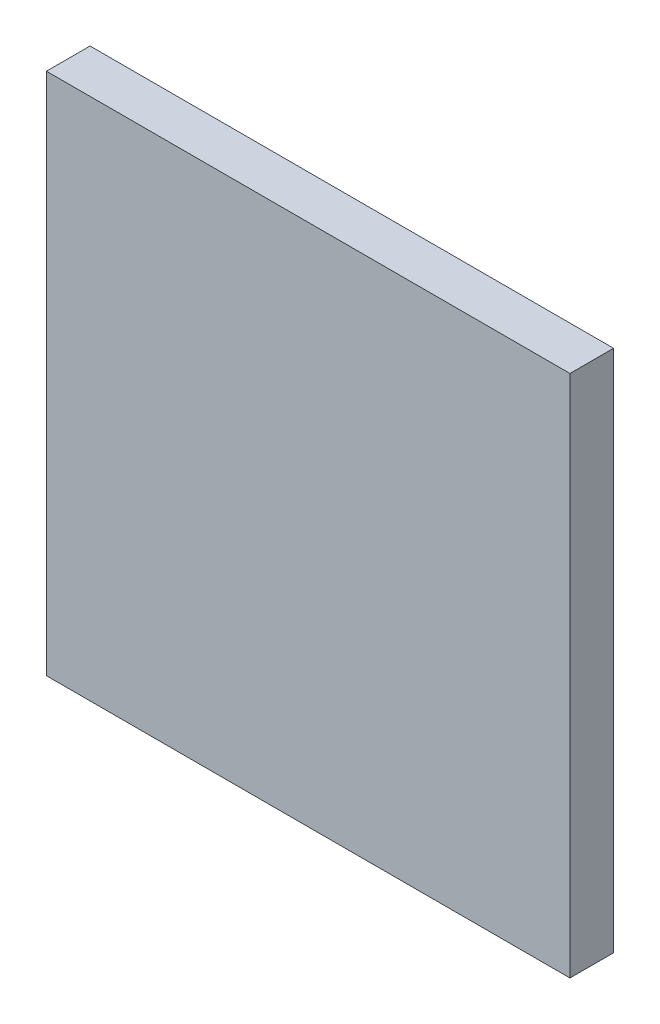
ISO-10303-21;
HEADER;
FILE_DESCRIPTION(('STEP AP214'),'2;1');
FILE_NAME('part.step','',(''),(''),'','','');
FILE_SCHEMA(('AUTOMOTIVE_DESIGN { 1 0 10303 214 1 1 1 1 }'));
ENDSEC;
DATA;
#1=APPLICATION_CONTEXT('core data for automotive mechanical design processes');
#2=APPLICATION_PROTOCOL_DEFINITION('international standard','automotive_design',2000,#1);
#3=PRODUCT_CONTEXT('',#1,'mechanical');
#4=PRODUCT('Part','Part','',(#3));
#5=PRODUCT_RELATED_PRODUCT_CATEGORY('part','',(#4));
#6=PRODUCT_DEFINITION_FORMATION('','',#4);
#7=PRODUCT_DEFINITION_CONTEXT('part definition',#1,'design');
#8=PRODUCT_DEFINITION('design','',#6,#7);
#9=PRODUCT_DEFINITION_SHAPE('','',#8);
#10=(LENGTH_UNIT() NAMED_UNIT(*) SI_UNIT(.MILLI.,.METRE.));
#11=(NAMED_UNIT(*) PLANE_ANGLE_UNIT() SI_UNIT($,.RADIAN.));
#12=(NAMED_UNIT(*) SI_UNIT($,.STERADIAN.) SOLID_ANGLE_UNIT());
#13=UNCERTAINTY_MEASURE_WITH_UNIT(LENGTH_MEASURE(1.E-05),#10,'distance_accuracy_value','');
#14=(GEOMETRIC_REPRESENTATION_CONTEXT(3) GLOBAL_UNCERTAINTY_ASSIGNED_CONTEXT((#13)) GLOBAL_UNIT_ASSIGNED_CONTEXT((#10,
#11,#12)) REPRESENTATION_CONTEXT('',''));
#15=CARTESIAN_POINT('',(0.,0.,0.));
#16=DIRECTION('',(0.,0.,1.));
#17=DIRECTION('',(1.,0.,0.));
#18=AXIS2_PLACEMENT_3D('',#15,#16,#17);
#19=CARTESIAN_POINT('',(0.,0.,6.35));
#20=DIRECTION('',(1.,0.,0.));
#21=DIRECTION('',(0.,1.,0.));
#22=AXIS2_PLACEMENT_3D('',#19,#20,#21);
#23=PLANE('',#22);
#24=DIRECTION('',(0.,-1.,0.));
#25=VECTOR('',#24,1.);
#26=CARTESIAN_POINT('',(0.,0.,0.));
#27=LINE('',#26,#25);
#28=CARTESIAN_POINT('',(0.,76.2,0.));
#29=VERTEX_POINT('',#28);
#30=CARTESIAN_POINT('',(0.,0.,0.));
#31=VERTEX_POINT('',#30);
#32=EDGE_CURVE('E96',#29,#31,#27,.T.);
#33=ORIENTED_EDGE('',*,*,#32,.T.);
#34=DIRECTION('',(0.,0.,-1.));
#35=VECTOR('',#34,1.);
#36=CARTESIAN_POINT('',(0.,0.,6.35));
#37=LINE('',#36,#35);
#38=CARTESIAN_POINT('',(0.,0.,6.35));
#39=VERTEX_POINT('',#38);
#40=EDGE_CURVE('E11',#39,#31,#37,.T.);
#41=ORIENTED_EDGE('',*,*,#40,.F.);
#42=DIRECTION('',(0.,-1.,0.));
#43=VECTOR('',#42,1.);
#44=CARTESIAN_POINT('',(0.,0.,6.35));
#45=LINE('',#44,#43);
#46=CARTESIAN_POINT('',(0.,76.2,6.35));
#47=VERTEX_POINT('',#46);
#48=EDGE_CURVE('E84',#47,#39,#45,.T.);
#49=ORIENTED_EDGE('',*,*,#48,.F.);
#50=DIRECTION('',(0.,0.,-1.));
#51=VECTOR('',#50,1.);
#52=CARTESIAN_POINT('',(0.,76.2,6.35));
#53=LINE('',#52,#51);
#54=EDGE_CURVE('E92',#47,#29,#53,.T.);
#55=ORIENTED_EDGE('',*,*,#54,.T.);
#56=EDGE_LOOP('',(#33,#41,#49,#55));
#57=FACE_BOUND('',#56,.T.);
#58=ADVANCED_FACE('F33',(#57),#23,.F.);
#59=CARTESIAN_POINT('',(0.,0.,6.35));
#60=DIRECTION('',(0.,1.,0.));
#61=DIRECTION('',(0.,0.,1.));
#62=AXIS2_PLACEMENT_3D('',#59,#60,#61);
#63=PLANE('',#62);
#64=DIRECTION('',(1.,0.,0.));
#65=VECTOR('',#64,1.);
#66=CARTESIAN_POINT('',(0.,0.,0.));
#67=LINE('',#66,#65);
#68=CARTESIAN_POINT('',(76.2,0.,0.));
#69=VERTEX_POINT('',#68);
#70=EDGE_CURVE('E88',#31,#69,#67,.T.);
#71=ORIENTED_EDGE('',*,*,#70,.T.);
#72=DIRECTION('',(0.,0.,-1.));
#73=VECTOR('',#72,1.);
#74=CARTESIAN_POINT('',(76.2,0.,6.35));
#75=LINE('',#74,#73);
#76=CARTESIAN_POINT('',(76.2,0.,6.35));
#77=VERTEX_POINT('',#76);
#78=EDGE_CURVE('E41',#77,#69,#75,.T.);
#79=ORIENTED_EDGE('',*,*,#78,.F.);
#80=DIRECTION('',(1.,0.,0.));
#81=VECTOR('',#80,1.);
#82=CARTESIAN_POINT('',(0.,0.,6.35));
#83=LINE('',#82,#81);
#84=EDGE_CURVE('E79',#39,#77,#83,.T.);
#85=ORIENTED_EDGE('',*,*,#84,.F.);
#86=ORIENTED_EDGE('',*,*,#40,.T.);
#87=EDGE_LOOP('',(#71,#79,#85,#86));
#88=FACE_BOUND('',#87,.T.);
#89=ADVANCED_FACE('F87',(#88),#63,.F.);
#90=CARTESIAN_POINT('',(76.2,0.,6.35));
#91=DIRECTION('',(-1.,0.,0.));
#92=DIRECTION('',(0.,-1.,0.));
#93=AXIS2_PLACEMENT_3D('',#90,#91,#92);
#94=PLANE('',#93);
#95=DIRECTION('',(0.,1.,0.));
#96=VECTOR('',#95,1.);
#97=CARTESIAN_POINT('',(76.2,0.,0.));
#98=LINE('',#97,#96);
#99=CARTESIAN_POINT('',(76.2,76.2,0.));
#100=VERTEX_POINT('',#99);
#101=EDGE_CURVE('E66',#69,#100,#98,.T.);
#102=ORIENTED_EDGE('',*,*,#101,.T.);
#103=DIRECTION('',(0.,0.,-1.));
#104=VECTOR('',#103,1.);
#105=CARTESIAN_POINT('',(76.2,76.2,6.35));
#106=LINE('',#105,#104);
#107=CARTESIAN_POINT('',(76.2,76.2,6.35));
#108=VERTEX_POINT('',#107);
#109=EDGE_CURVE('E89',#108,#100,#106,.T.);
#110=ORIENTED_EDGE('',*,*,#109,.F.);
#111=DIRECTION('',(0.,1.,0.));
#112=VECTOR('',#111,1.);
#113=CARTESIAN_POINT('',(76.2,0.,6.35));
#114=LINE('',#113,#112);
#115=EDGE_CURVE('E82',#77,#108,#114,.T.);
#116=ORIENTED_EDGE('',*,*,#115,.F.);
#117=ORIENTED_EDGE('',*,*,#78,.T.);
#118=EDGE_LOOP('',(#102,#110,#116,#117));
#119=FACE_BOUND('',#118,.T.);
#120=ADVANCED_FACE('F90',(#119),#94,.F.);
#121=CARTESIAN_POINT('',(0.,76.2,6.35));
#122=DIRECTION('',(0.,-1.,0.));
#123=DIRECTION('',(0.,0.,-1.));
#124=AXIS2_PLACEMENT_3D('',#121,#122,#123);
#125=PLANE('',#124);
#126=DIRECTION('',(-1.,0.,0.));
#127=VECTOR('',#126,1.);
#128=CARTESIAN_POINT('',(0.,76.2,0.));
#129=LINE('',#128,#127);
#130=EDGE_CURVE('E72',#100,#29,#129,.T.);
#131=ORIENTED_EDGE('',*,*,#130,.T.);
#132=ORIENTED_EDGE('',*,*,#54,.F.);
#133=DIRECTION('',(-1.,0.,0.));
#134=VECTOR('',#133,1.);
#135=CARTESIAN_POINT('',(0.,76.2,6.35));
#136=LINE('',#135,#134);
#137=EDGE_CURVE('E49',#108,#47,#136,.T.);
#138=ORIENTED_EDGE('',*,*,#137,.F.);
#139=ORIENTED_EDGE('',*,*,#109,.T.);
#140=EDGE_LOOP('',(#131,#132,#138,#139));
#141=FACE_BOUND('',#140,.T.);
#142=ADVANCED_FACE('F103',(#141),#125,.F.);
#143=CARTESIAN_POINT('',(0.,0.,6.35));
#144=DIRECTION('',(0.,0.,-1.));
#145=DIRECTION('',(-1.,0.,0.));
#146=AXIS2_PLACEMENT_3D('',#143,#144,#145);
#147=PLANE('',#146);
#148=ORIENTED_EDGE('',*,*,#48,.T.);
#149=ORIENTED_EDGE('',*,*,#84,.T.);
#150=ORIENTED_EDGE('',*,*,#115,.T.);
#151=ORIENTED_EDGE('',*,*,#137,.T.);
#152=EDGE_LOOP('',(#148,#149,#150,#151));
#153=FACE_BOUND('',#152,.T.);
#154=ADVANCED_FACE('F80',(#153),#147,.F.);
#155=CARTESIAN_POINT('',(0.,0.,0.));
#156=DIRECTION('',(0.,0.,-1.));
#157=DIRECTION('',(-1.,0.,0.));
#158=AXIS2_PLACEMENT_3D('',#155,#156,#157);
#159=PLANE('',#158);
#160=ORIENTED_EDGE('',*,*,#32,.F.);
#161=ORIENTED_EDGE('',*,*,#130,.F.);
#162=ORIENTED_EDGE('',*,*,#101,.F.);
#163=ORIENTED_EDGE('',*,*,#70,.F.);
#164=EDGE_LOOP('',(#160,#161,#162,#163));
#165=FACE_BOUND('',#164,.T.);
#166=ADVANCED_FACE('F106',(#165),#159,.T.);
#167=CLOSED_SHELL('',(#58,#89,#120,#142,#154,#166));
#168=MANIFOLD_SOLID_BREP('B2',#167);
#169=ADVANCED_BREP_SHAPE_REPRESENTATION('',(#18,#168),#14);
#170=SHAPE_DEFINITION_REPRESENTATION(#9,#169);
ENDSEC;
END-ISO-10303-21;
